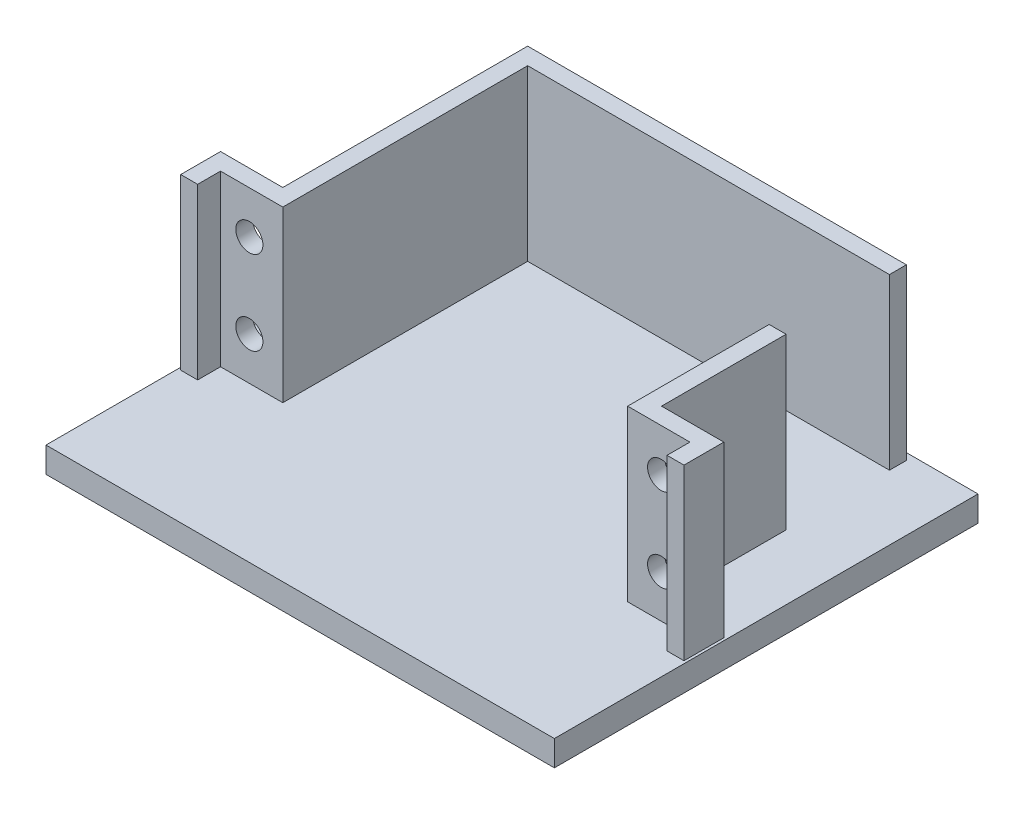
ISO-10303-21;
HEADER;
FILE_DESCRIPTION(('STEP AP214'),'2;1');
FILE_NAME('part.step','',(''),(''),'','','');
FILE_SCHEMA(('AUTOMOTIVE_DESIGN { 1 0 10303 214 1 1 1 1 }'));
ENDSEC;
DATA;
#1=APPLICATION_CONTEXT('core data for automotive mechanical design processes');
#2=APPLICATION_PROTOCOL_DEFINITION('international standard','automotive_design',2000,#1);
#3=PRODUCT_CONTEXT('',#1,'mechanical');
#4=PRODUCT('Part','Part','',(#3));
#5=PRODUCT_RELATED_PRODUCT_CATEGORY('part','',(#4));
#6=PRODUCT_DEFINITION_FORMATION('','',#4);
#7=PRODUCT_DEFINITION_CONTEXT('part definition',#1,'design');
#8=PRODUCT_DEFINITION('design','',#6,#7);
#9=PRODUCT_DEFINITION_SHAPE('','',#8);
#10=(LENGTH_UNIT() NAMED_UNIT(*) SI_UNIT(.MILLI.,.METRE.));
#11=(NAMED_UNIT(*) PLANE_ANGLE_UNIT() SI_UNIT($,.RADIAN.));
#12=(NAMED_UNIT(*) SI_UNIT($,.STERADIAN.) SOLID_ANGLE_UNIT());
#13=UNCERTAINTY_MEASURE_WITH_UNIT(LENGTH_MEASURE(1.E-05),#10,'distance_accuracy_value','');
#14=(GEOMETRIC_REPRESENTATION_CONTEXT(3) GLOBAL_UNCERTAINTY_ASSIGNED_CONTEXT((#13)) GLOBAL_UNIT_ASSIGNED_CONTEXT((#10,
#11,#12)) REPRESENTATION_CONTEXT('',''));
#15=CARTESIAN_POINT('',(0.,0.,0.));
#16=DIRECTION('',(0.,0.,1.));
#17=DIRECTION('',(1.,0.,0.));
#18=AXIS2_PLACEMENT_3D('',#15,#16,#17);
#19=CARTESIAN_POINT('',(0.,0.,0.));
#20=DIRECTION('',(0.,1.,0.));
#21=DIRECTION('',(0.,0.,1.));
#22=AXIS2_PLACEMENT_3D('',#19,#20,#21);
#23=PLANE('',#22);
#24=DIRECTION('',(0.,0.,1.));
#25=VECTOR('',#24,1.);
#26=CARTESIAN_POINT('',(-30.,0.,-25.));
#27=LINE('',#26,#25);
#28=CARTESIAN_POINT('',(-30.,0.,-25.));
#29=VERTEX_POINT('',#28);
#30=CARTESIAN_POINT('',(-30.,0.,25.));
#31=VERTEX_POINT('',#30);
#32=EDGE_CURVE('E271',#29,#31,#27,.T.);
#33=ORIENTED_EDGE('',*,*,#32,.T.);
#34=DIRECTION('',(1.,0.,0.));
#35=VECTOR('',#34,1.);
#36=CARTESIAN_POINT('',(-30.,0.,25.));
#37=LINE('',#36,#35);
#38=CARTESIAN_POINT('',(30.,0.,25.));
#39=VERTEX_POINT('',#38);
#40=EDGE_CURVE('E288',#31,#39,#37,.T.);
#41=ORIENTED_EDGE('',*,*,#40,.T.);
#42=DIRECTION('',(0.,0.,-1.));
#43=VECTOR('',#42,1.);
#44=CARTESIAN_POINT('',(30.,0.,-25.));
#45=LINE('',#44,#43);
#46=CARTESIAN_POINT('',(30.,0.,-25.));
#47=VERTEX_POINT('',#46);
#48=EDGE_CURVE('E291',#39,#47,#45,.T.);
#49=ORIENTED_EDGE('',*,*,#48,.T.);
#50=DIRECTION('',(-1.,0.,0.));
#51=VECTOR('',#50,1.);
#52=CARTESIAN_POINT('',(-30.,0.,-25.));
#53=LINE('',#52,#51);
#54=EDGE_CURVE('E276',#47,#29,#53,.T.);
#55=ORIENTED_EDGE('',*,*,#54,.T.);
#56=EDGE_LOOP('',(#33,#41,#49,#55));
#57=FACE_BOUND('',#56,.T.);
#58=DIRECTION('',(0.,0.,-1.));
#59=VECTOR('',#58,1.);
#60=CARTESIAN_POINT('',(-27.7,0.,6.69999999999999));
#61=LINE('',#60,#59);
#62=CARTESIAN_POINT('',(-27.7,0.,9.39999999999999));
#63=VERTEX_POINT('',#62);
#64=CARTESIAN_POINT('',(-27.7,0.,6.69999999999999));
#65=VERTEX_POINT('',#64);
#66=EDGE_CURVE('E85',#63,#65,#61,.T.);
#67=ORIENTED_EDGE('',*,*,#66,.F.);
#68=DIRECTION('',(1.,0.,0.));
#69=VECTOR('',#68,1.);
#70=CARTESIAN_POINT('',(-29.7,0.,9.39999999999999));
#71=LINE('',#70,#69);
#72=CARTESIAN_POINT('',(-29.7,0.,9.39999999999999));
#73=VERTEX_POINT('',#72);
#74=EDGE_CURVE('E159',#73,#63,#71,.T.);
#75=ORIENTED_EDGE('',*,*,#74,.F.);
#76=DIRECTION('',(0.,0.,1.));
#77=VECTOR('',#76,1.);
#78=CARTESIAN_POINT('',(-29.7,0.,4.69999999999999));
#79=LINE('',#78,#77);
#80=CARTESIAN_POINT('',(-29.7,0.,4.69999999999999));
#81=VERTEX_POINT('',#80);
#82=EDGE_CURVE('E157',#81,#73,#79,.T.);
#83=ORIENTED_EDGE('',*,*,#82,.F.);
#84=DIRECTION('',(-1.,0.,0.));
#85=VECTOR('',#84,1.);
#86=CARTESIAN_POINT('',(-22.35,0.,4.69999999999999));
#87=LINE('',#86,#85);
#88=CARTESIAN_POINT('',(-22.35,0.,4.69999999999999));
#89=VERTEX_POINT('',#88);
#90=EDGE_CURVE('E126',#89,#81,#87,.T.);
#91=ORIENTED_EDGE('',*,*,#90,.F.);
#92=DIRECTION('',(0.,0.,1.));
#93=VECTOR('',#92,1.);
#94=CARTESIAN_POINT('',(-22.35,0.,-24.2000000000001));
#95=LINE('',#94,#93);
#96=CARTESIAN_POINT('',(-22.35,0.,-24.2000000000001));
#97=VERTEX_POINT('',#96);
#98=EDGE_CURVE('E153',#97,#89,#95,.T.);
#99=ORIENTED_EDGE('',*,*,#98,.F.);
#100=DIRECTION('',(-1.,0.,0.));
#101=VECTOR('',#100,1.);
#102=CARTESIAN_POINT('',(-22.35,0.,-24.2000000000001));
#103=LINE('',#102,#101);
#104=CARTESIAN_POINT('',(22.35,0.,-24.2000000000001));
#105=VERTEX_POINT('',#104);
#106=EDGE_CURVE('E150',#105,#97,#103,.T.);
#107=ORIENTED_EDGE('',*,*,#106,.F.);
#108=DIRECTION('',(0.,0.,-1.));
#109=VECTOR('',#108,1.);
#110=CARTESIAN_POINT('',(22.35,0.,-24.2000000000001));
#111=LINE('',#110,#109);
#112=CARTESIAN_POINT('',(22.35,0.,-22.2000000000001));
#113=VERTEX_POINT('',#112);
#114=EDGE_CURVE('E147',#113,#105,#111,.T.);
#115=ORIENTED_EDGE('',*,*,#114,.F.);
#116=DIRECTION('',(1.,0.,0.));
#117=VECTOR('',#116,1.);
#118=CARTESIAN_POINT('',(-20.35,0.,-22.2000000000001));
#119=LINE('',#118,#117);
#120=CARTESIAN_POINT('',(-20.35,0.,-22.2000000000001));
#121=VERTEX_POINT('',#120);
#122=EDGE_CURVE('E144',#121,#113,#119,.T.);
#123=ORIENTED_EDGE('',*,*,#122,.F.);
#124=DIRECTION('',(0.,0.,-1.));
#125=VECTOR('',#124,1.);
#126=CARTESIAN_POINT('',(-20.35,0.,-22.2000000000001));
#127=LINE('',#126,#125);
#128=CARTESIAN_POINT('',(-20.35,0.,6.69999999999999));
#129=VERTEX_POINT('',#128);
#130=EDGE_CURVE('E75',#129,#121,#127,.T.);
#131=ORIENTED_EDGE('',*,*,#130,.F.);
#132=DIRECTION('',(1.,0.,0.));
#133=VECTOR('',#132,1.);
#134=CARTESIAN_POINT('',(-20.35,0.,6.69999999999999));
#135=LINE('',#134,#133);
#136=EDGE_CURVE('E140',#65,#129,#135,.T.);
#137=ORIENTED_EDGE('',*,*,#136,.F.);
#138=EDGE_LOOP('',(#67,#75,#83,#91,#99,#107,#115,#123,#131,#137));
#139=FACE_BOUND('',#138,.T.);
#140=DIRECTION('',(0.,0.,-1.));
#141=VECTOR('',#140,1.);
#142=CARTESIAN_POINT('',(29.7,0.,4.69999999999998));
#143=LINE('',#142,#141);
#144=CARTESIAN_POINT('',(29.7,0.,9.39999999999999));
#145=VERTEX_POINT('',#144);
#146=CARTESIAN_POINT('',(29.7,0.,4.69999999999998));
#147=VERTEX_POINT('',#146);
#148=EDGE_CURVE('E232',#145,#147,#143,.T.);
#149=ORIENTED_EDGE('',*,*,#148,.F.);
#150=DIRECTION('',(1.,0.,0.));
#151=VECTOR('',#150,1.);
#152=CARTESIAN_POINT('',(27.7,0.,9.39999999999999));
#153=LINE('',#152,#151);
#154=CARTESIAN_POINT('',(27.7,0.,9.39999999999999));
#155=VERTEX_POINT('',#154);
#156=EDGE_CURVE('E203',#155,#145,#153,.T.);
#157=ORIENTED_EDGE('',*,*,#156,.F.);
#158=DIRECTION('',(0.,0.,1.));
#159=VECTOR('',#158,1.);
#160=CARTESIAN_POINT('',(27.7,0.,6.69999999999998));
#161=LINE('',#160,#159);
#162=CARTESIAN_POINT('',(27.7,0.,6.69999999999998));
#163=VERTEX_POINT('',#162);
#164=EDGE_CURVE('E208',#163,#155,#161,.T.);
#165=ORIENTED_EDGE('',*,*,#164,.F.);
#166=DIRECTION('',(1.,0.,0.));
#167=VECTOR('',#166,1.);
#168=CARTESIAN_POINT('',(20.35,0.,6.69999999999998));
#169=LINE('',#168,#167);
#170=CARTESIAN_POINT('',(20.35,0.,6.69999999999998));
#171=VERTEX_POINT('',#170);
#172=EDGE_CURVE('E247',#171,#163,#169,.T.);
#173=ORIENTED_EDGE('',*,*,#172,.F.);
#174=DIRECTION('',(0.,0.,1.));
#175=VECTOR('',#174,1.);
#176=CARTESIAN_POINT('',(20.35,0.,6.69999999999998));
#177=LINE('',#176,#175);
#178=CARTESIAN_POINT('',(20.35,0.,-10.));
#179=VERTEX_POINT('',#178);
#180=EDGE_CURVE('E244',#179,#171,#177,.T.);
#181=ORIENTED_EDGE('',*,*,#180,.F.);
#182=DIRECTION('',(-1.,0.,0.));
#183=VECTOR('',#182,1.);
#184=CARTESIAN_POINT('',(20.35,0.,-10.));
#185=LINE('',#184,#183);
#186=CARTESIAN_POINT('',(22.35,0.,-10.));
#187=VERTEX_POINT('',#186);
#188=EDGE_CURVE('E241',#187,#179,#185,.T.);
#189=ORIENTED_EDGE('',*,*,#188,.F.);
#190=DIRECTION('',(0.,0.,-1.));
#191=VECTOR('',#190,1.);
#192=CARTESIAN_POINT('',(22.35,0.,4.69999999999998));
#193=LINE('',#192,#191);
#194=CARTESIAN_POINT('',(22.35,0.,4.69999999999998));
#195=VERTEX_POINT('',#194);
#196=EDGE_CURVE('E238',#195,#187,#193,.T.);
#197=ORIENTED_EDGE('',*,*,#196,.F.);
#198=DIRECTION('',(-1.,0.,0.));
#199=VECTOR('',#198,1.);
#200=CARTESIAN_POINT('',(22.35,0.,4.69999999999998));
#201=LINE('',#200,#199);
#202=EDGE_CURVE('E235',#147,#195,#201,.T.);
#203=ORIENTED_EDGE('',*,*,#202,.F.);
#204=EDGE_LOOP('',(#149,#157,#165,#173,#181,#189,#197,#203));
#205=FACE_BOUND('',#204,.T.);
#206=ADVANCED_FACE('F36',(#57,#139,#205),#23,.T.);
#207=CARTESIAN_POINT('',(-27.7,20.,6.69999999999999));
#208=DIRECTION('',(-1.,0.,0.));
#209=DIRECTION('',(0.,0.,1.));
#210=AXIS2_PLACEMENT_3D('',#207,#208,#209);
#211=PLANE('',#210);
#212=ORIENTED_EDGE('',*,*,#66,.T.);
#213=DIRECTION('',(0.,-1.,0.));
#214=VECTOR('',#213,1.);
#215=CARTESIAN_POINT('',(-27.7,20.,6.69999999999999));
#216=LINE('',#215,#214);
#217=CARTESIAN_POINT('',(-27.7,20.,6.69999999999999));
#218=VERTEX_POINT('',#217);
#219=EDGE_CURVE('E11',#218,#65,#216,.T.);
#220=ORIENTED_EDGE('',*,*,#219,.F.);
#221=DIRECTION('',(0.,0.,-1.));
#222=VECTOR('',#221,1.);
#223=CARTESIAN_POINT('',(-27.7,20.,6.69999999999999));
#224=LINE('',#223,#222);
#225=CARTESIAN_POINT('',(-27.7,20.,9.39999999999999));
#226=VERTEX_POINT('',#225);
#227=EDGE_CURVE('E161',#226,#218,#224,.T.);
#228=ORIENTED_EDGE('',*,*,#227,.F.);
#229=DIRECTION('',(0.,-1.,0.));
#230=VECTOR('',#229,1.);
#231=CARTESIAN_POINT('',(-27.7,20.,9.39999999999999));
#232=LINE('',#231,#230);
#233=EDGE_CURVE('E135',#226,#63,#232,.T.);
#234=ORIENTED_EDGE('',*,*,#233,.T.);
#235=EDGE_LOOP('',(#212,#220,#228,#234));
#236=FACE_BOUND('',#235,.T.);
#237=ADVANCED_FACE('F38',(#236),#211,.F.);
#238=CARTESIAN_POINT('',(-20.35,20.,6.69999999999999));
#239=DIRECTION('',(0.,0.,-1.));
#240=DIRECTION('',(-1.,0.,0.));
#241=AXIS2_PLACEMENT_3D('',#238,#239,#240);
#242=PLANE('',#241);
#243=CARTESIAN_POINT('',(-24.3,5.05,6.69999999999999));
#244=DIRECTION('',(0.,0.,-1.));
#245=DIRECTION('',(-1.,0.,0.));
#246=AXIS2_PLACEMENT_3D('',#243,#244,#245);
#247=CIRCLE('',#246,1.6);
#248=CARTESIAN_POINT('',(-25.9,5.05,6.69999999999999));
#249=VERTEX_POINT('',#248);
#250=EDGE_CURVE('E200',#249,#249,#247,.F.);
#251=ORIENTED_EDGE('',*,*,#250,.F.);
#252=EDGE_LOOP('',(#251));
#253=FACE_BOUND('',#252,.T.);
#254=CARTESIAN_POINT('',(-24.3,14.95,6.69999999999999));
#255=DIRECTION('',(0.,0.,-1.));
#256=DIRECTION('',(-1.,0.,0.));
#257=AXIS2_PLACEMENT_3D('',#254,#255,#256);
#258=CIRCLE('',#257,1.6);
#259=CARTESIAN_POINT('',(-25.9,14.95,6.69999999999999));
#260=VERTEX_POINT('',#259);
#261=EDGE_CURVE('E189',#260,#260,#258,.F.);
#262=ORIENTED_EDGE('',*,*,#261,.F.);
#263=EDGE_LOOP('',(#262));
#264=FACE_BOUND('',#263,.T.);
#265=ORIENTED_EDGE('',*,*,#136,.T.);
#266=DIRECTION('',(0.,-1.,0.));
#267=VECTOR('',#266,1.);
#268=CARTESIAN_POINT('',(-20.35,20.,6.69999999999999));
#269=LINE('',#268,#267);
#270=CARTESIAN_POINT('',(-20.35,20.,6.69999999999999));
#271=VERTEX_POINT('',#270);
#272=EDGE_CURVE('E45',#271,#129,#269,.T.);
#273=ORIENTED_EDGE('',*,*,#272,.F.);
#274=DIRECTION('',(1.,0.,0.));
#275=VECTOR('',#274,1.);
#276=CARTESIAN_POINT('',(-20.35,20.,6.69999999999999));
#277=LINE('',#276,#275);
#278=EDGE_CURVE('E307',#218,#271,#277,.T.);
#279=ORIENTED_EDGE('',*,*,#278,.F.);
#280=ORIENTED_EDGE('',*,*,#219,.T.);
#281=EDGE_LOOP('',(#265,#273,#279,#280));
#282=FACE_BOUND('',#281,.T.);
#283=ADVANCED_FACE('F446',(#253,#264,#282),#242,.F.);
#284=CARTESIAN_POINT('',(-20.35,20.,-22.2000000000001));
#285=DIRECTION('',(-1.,0.,0.));
#286=DIRECTION('',(0.,0.,1.));
#287=AXIS2_PLACEMENT_3D('',#284,#285,#286);
#288=PLANE('',#287);
#289=ORIENTED_EDGE('',*,*,#130,.T.);
#290=DIRECTION('',(0.,-1.,0.));
#291=VECTOR('',#290,1.);
#292=CARTESIAN_POINT('',(-20.35,20.,-22.2000000000001));
#293=LINE('',#292,#291);
#294=CARTESIAN_POINT('',(-20.35,20.,-22.2000000000001));
#295=VERTEX_POINT('',#294);
#296=EDGE_CURVE('E175',#295,#121,#293,.T.);
#297=ORIENTED_EDGE('',*,*,#296,.F.);
#298=DIRECTION('',(0.,0.,-1.));
#299=VECTOR('',#298,1.);
#300=CARTESIAN_POINT('',(-20.35,20.,-22.2000000000001));
#301=LINE('',#300,#299);
#302=EDGE_CURVE('E309',#271,#295,#301,.T.);
#303=ORIENTED_EDGE('',*,*,#302,.F.);
#304=ORIENTED_EDGE('',*,*,#272,.T.);
#305=EDGE_LOOP('',(#289,#297,#303,#304));
#306=FACE_BOUND('',#305,.T.);
#307=ADVANCED_FACE('F490',(#306),#288,.F.);
#308=CARTESIAN_POINT('',(-20.35,20.,-22.2000000000001));
#309=DIRECTION('',(0.,0.,-1.));
#310=DIRECTION('',(-1.,0.,0.));
#311=AXIS2_PLACEMENT_3D('',#308,#309,#310);
#312=PLANE('',#311);
#313=ORIENTED_EDGE('',*,*,#122,.T.);
#314=DIRECTION('',(0.,-1.,0.));
#315=VECTOR('',#314,1.);
#316=CARTESIAN_POINT('',(22.35,20.,-22.2000000000001));
#317=LINE('',#316,#315);
#318=CARTESIAN_POINT('',(22.35,20.,-22.2000000000001));
#319=VERTEX_POINT('',#318);
#320=EDGE_CURVE('E172',#319,#113,#317,.T.);
#321=ORIENTED_EDGE('',*,*,#320,.F.);
#322=DIRECTION('',(1.,0.,0.));
#323=VECTOR('',#322,1.);
#324=CARTESIAN_POINT('',(-20.35,20.,-22.2000000000001));
#325=LINE('',#324,#323);
#326=EDGE_CURVE('E311',#295,#319,#325,.T.);
#327=ORIENTED_EDGE('',*,*,#326,.F.);
#328=ORIENTED_EDGE('',*,*,#296,.T.);
#329=EDGE_LOOP('',(#313,#321,#327,#328));
#330=FACE_BOUND('',#329,.T.);
#331=ADVANCED_FACE('F486',(#330),#312,.F.);
#332=CARTESIAN_POINT('',(22.35,20.,-24.2000000000001));
#333=DIRECTION('',(-1.,0.,0.));
#334=DIRECTION('',(0.,0.,1.));
#335=AXIS2_PLACEMENT_3D('',#332,#333,#334);
#336=PLANE('',#335);
#337=ORIENTED_EDGE('',*,*,#114,.T.);
#338=DIRECTION('',(0.,-1.,0.));
#339=VECTOR('',#338,1.);
#340=CARTESIAN_POINT('',(22.35,20.,-24.2000000000001));
#341=LINE('',#340,#339);
#342=CARTESIAN_POINT('',(22.35,20.,-24.2000000000001));
#343=VERTEX_POINT('',#342);
#344=EDGE_CURVE('E169',#343,#105,#341,.T.);
#345=ORIENTED_EDGE('',*,*,#344,.F.);
#346=DIRECTION('',(0.,0.,-1.));
#347=VECTOR('',#346,1.);
#348=CARTESIAN_POINT('',(22.35,20.,-24.2000000000001));
#349=LINE('',#348,#347);
#350=EDGE_CURVE('E313',#319,#343,#349,.T.);
#351=ORIENTED_EDGE('',*,*,#350,.F.);
#352=ORIENTED_EDGE('',*,*,#320,.T.);
#353=EDGE_LOOP('',(#337,#345,#351,#352));
#354=FACE_BOUND('',#353,.T.);
#355=ADVANCED_FACE('F483',(#354),#336,.F.);
#356=CARTESIAN_POINT('',(-22.35,20.,-24.2000000000001));
#357=DIRECTION('',(0.,0.,1.));
#358=DIRECTION('',(1.,0.,0.));
#359=AXIS2_PLACEMENT_3D('',#356,#357,#358);
#360=PLANE('',#359);
#361=ORIENTED_EDGE('',*,*,#106,.T.);
#362=DIRECTION('',(0.,-1.,0.));
#363=VECTOR('',#362,1.);
#364=CARTESIAN_POINT('',(-22.35,20.,-24.2000000000001));
#365=LINE('',#364,#363);
#366=CARTESIAN_POINT('',(-22.35,20.,-24.2000000000001));
#367=VERTEX_POINT('',#366);
#368=EDGE_CURVE('E166',#367,#97,#365,.T.);
#369=ORIENTED_EDGE('',*,*,#368,.F.);
#370=DIRECTION('',(-1.,0.,0.));
#371=VECTOR('',#370,1.);
#372=CARTESIAN_POINT('',(-22.35,20.,-24.2000000000001));
#373=LINE('',#372,#371);
#374=EDGE_CURVE('E315',#343,#367,#373,.T.);
#375=ORIENTED_EDGE('',*,*,#374,.F.);
#376=ORIENTED_EDGE('',*,*,#344,.T.);
#377=EDGE_LOOP('',(#361,#369,#375,#376));
#378=FACE_BOUND('',#377,.T.);
#379=ADVANCED_FACE('F321',(#378),#360,.F.);
#380=CARTESIAN_POINT('',(-22.35,20.,-24.2000000000001));
#381=DIRECTION('',(1.,0.,0.));
#382=DIRECTION('',(0.,0.,-1.));
#383=AXIS2_PLACEMENT_3D('',#380,#381,#382);
#384=PLANE('',#383);
#385=ORIENTED_EDGE('',*,*,#98,.T.);
#386=DIRECTION('',(0.,-1.,0.));
#387=VECTOR('',#386,1.);
#388=CARTESIAN_POINT('',(-22.35,20.,4.69999999999999));
#389=LINE('',#388,#387);
#390=CARTESIAN_POINT('',(-22.35,20.,4.69999999999999));
#391=VERTEX_POINT('',#390);
#392=EDGE_CURVE('E129',#391,#89,#389,.T.);
#393=ORIENTED_EDGE('',*,*,#392,.F.);
#394=DIRECTION('',(0.,0.,1.));
#395=VECTOR('',#394,1.);
#396=CARTESIAN_POINT('',(-22.35,20.,-24.2000000000001));
#397=LINE('',#396,#395);
#398=EDGE_CURVE('E116',#367,#391,#397,.T.);
#399=ORIENTED_EDGE('',*,*,#398,.F.);
#400=ORIENTED_EDGE('',*,*,#368,.T.);
#401=EDGE_LOOP('',(#385,#393,#399,#400));
#402=FACE_BOUND('',#401,.T.);
#403=ADVANCED_FACE('F325',(#402),#384,.F.);
#404=CARTESIAN_POINT('',(-22.35,20.,4.69999999999999));
#405=DIRECTION('',(0.,0.,1.));
#406=DIRECTION('',(1.,0.,0.));
#407=AXIS2_PLACEMENT_3D('',#404,#405,#406);
#408=PLANE('',#407);
#409=CARTESIAN_POINT('',(-24.3,5.05,4.69999999999999));
#410=DIRECTION('',(0.,0.,1.));
#411=DIRECTION('',(1.,0.,0.));
#412=AXIS2_PLACEMENT_3D('',#409,#410,#411);
#413=CIRCLE('',#412,1.6);
#414=CARTESIAN_POINT('',(-22.7,5.05,4.69999999999999));
#415=VERTEX_POINT('',#414);
#416=EDGE_CURVE('E40',#415,#415,#413,.F.);
#417=ORIENTED_EDGE('',*,*,#416,.F.);
#418=EDGE_LOOP('',(#417));
#419=FACE_BOUND('',#418,.T.);
#420=CARTESIAN_POINT('',(-24.3,14.95,4.69999999999999));
#421=DIRECTION('',(0.,0.,1.));
#422=DIRECTION('',(1.,0.,0.));
#423=AXIS2_PLACEMENT_3D('',#420,#421,#422);
#424=CIRCLE('',#423,1.6);
#425=CARTESIAN_POINT('',(-22.7,14.95,4.69999999999999));
#426=VERTEX_POINT('',#425);
#427=EDGE_CURVE('E187',#426,#426,#424,.F.);
#428=ORIENTED_EDGE('',*,*,#427,.F.);
#429=EDGE_LOOP('',(#428));
#430=FACE_BOUND('',#429,.T.);
#431=ORIENTED_EDGE('',*,*,#90,.T.);
#432=DIRECTION('',(0.,-1.,0.));
#433=VECTOR('',#432,1.);
#434=CARTESIAN_POINT('',(-29.7,20.,4.69999999999999));
#435=LINE('',#434,#433);
#436=CARTESIAN_POINT('',(-29.7,20.,4.69999999999999));
#437=VERTEX_POINT('',#436);
#438=EDGE_CURVE('E123',#437,#81,#435,.T.);
#439=ORIENTED_EDGE('',*,*,#438,.F.);
#440=DIRECTION('',(-1.,0.,0.));
#441=VECTOR('',#440,1.);
#442=CARTESIAN_POINT('',(-22.35,20.,4.69999999999999));
#443=LINE('',#442,#441);
#444=EDGE_CURVE('E109',#391,#437,#443,.T.);
#445=ORIENTED_EDGE('',*,*,#444,.F.);
#446=ORIENTED_EDGE('',*,*,#392,.T.);
#447=EDGE_LOOP('',(#431,#439,#445,#446));
#448=FACE_BOUND('',#447,.T.);
#449=ADVANCED_FACE('F124',(#419,#430,#448),#408,.F.);
#450=CARTESIAN_POINT('',(-29.7,20.,4.69999999999999));
#451=DIRECTION('',(1.,0.,0.));
#452=DIRECTION('',(0.,0.,-1.));
#453=AXIS2_PLACEMENT_3D('',#450,#451,#452);
#454=PLANE('',#453);
#455=ORIENTED_EDGE('',*,*,#82,.T.);
#456=DIRECTION('',(0.,-1.,0.));
#457=VECTOR('',#456,1.);
#458=CARTESIAN_POINT('',(-29.7,20.,9.39999999999999));
#459=LINE('',#458,#457);
#460=CARTESIAN_POINT('',(-29.7,20.,9.39999999999999));
#461=VERTEX_POINT('',#460);
#462=EDGE_CURVE('E130',#461,#73,#459,.T.);
#463=ORIENTED_EDGE('',*,*,#462,.F.);
#464=DIRECTION('',(0.,0.,1.));
#465=VECTOR('',#464,1.);
#466=CARTESIAN_POINT('',(-29.7,20.,4.69999999999999));
#467=LINE('',#466,#465);
#468=EDGE_CURVE('E113',#437,#461,#467,.T.);
#469=ORIENTED_EDGE('',*,*,#468,.F.);
#470=ORIENTED_EDGE('',*,*,#438,.T.);
#471=EDGE_LOOP('',(#455,#463,#469,#470));
#472=FACE_BOUND('',#471,.T.);
#473=ADVANCED_FACE('F132',(#472),#454,.F.);
#474=CARTESIAN_POINT('',(-29.7,20.,9.39999999999999));
#475=DIRECTION('',(0.,0.,-1.));
#476=DIRECTION('',(-1.,0.,0.));
#477=AXIS2_PLACEMENT_3D('',#474,#475,#476);
#478=PLANE('',#477);
#479=ORIENTED_EDGE('',*,*,#74,.T.);
#480=ORIENTED_EDGE('',*,*,#233,.F.);
#481=DIRECTION('',(1.,0.,0.));
#482=VECTOR('',#481,1.);
#483=CARTESIAN_POINT('',(-29.7,20.,9.39999999999999));
#484=LINE('',#483,#482);
#485=EDGE_CURVE('E62',#461,#226,#484,.T.);
#486=ORIENTED_EDGE('',*,*,#485,.F.);
#487=ORIENTED_EDGE('',*,*,#462,.T.);
#488=EDGE_LOOP('',(#479,#480,#486,#487));
#489=FACE_BOUND('',#488,.T.);
#490=ADVANCED_FACE('F470',(#489),#478,.F.);
#491=CARTESIAN_POINT('',(0.,20.,0.));
#492=DIRECTION('',(0.,1.,0.));
#493=DIRECTION('',(0.,0.,1.));
#494=AXIS2_PLACEMENT_3D('',#491,#492,#493);
#495=PLANE('',#494);
#496=ORIENTED_EDGE('',*,*,#227,.T.);
#497=ORIENTED_EDGE('',*,*,#278,.T.);
#498=ORIENTED_EDGE('',*,*,#302,.T.);
#499=ORIENTED_EDGE('',*,*,#326,.T.);
#500=ORIENTED_EDGE('',*,*,#350,.T.);
#501=ORIENTED_EDGE('',*,*,#374,.T.);
#502=ORIENTED_EDGE('',*,*,#398,.T.);
#503=ORIENTED_EDGE('',*,*,#444,.T.);
#504=ORIENTED_EDGE('',*,*,#468,.T.);
#505=ORIENTED_EDGE('',*,*,#485,.T.);
#506=EDGE_LOOP('',(#496,#497,#498,#499,#500,#501,#502,#503,#504,#505));
#507=FACE_BOUND('',#506,.T.);
#508=ADVANCED_FACE('F111',(#507),#495,.T.);
#509=CARTESIAN_POINT('',(-30.,-3.,-25.));
#510=DIRECTION('',(-1.,0.,0.));
#511=DIRECTION('',(0.,0.,1.));
#512=AXIS2_PLACEMENT_3D('',#509,#510,#511);
#513=PLANE('',#512);
#514=ORIENTED_EDGE('',*,*,#32,.F.);
#515=DIRECTION('',(0.,1.,0.));
#516=VECTOR('',#515,1.);
#517=CARTESIAN_POINT('',(-30.,-3.,-25.));
#518=LINE('',#517,#516);
#519=CARTESIAN_POINT('',(-30.,-3.,-25.));
#520=VERTEX_POINT('',#519);
#521=EDGE_CURVE('E141',#520,#29,#518,.T.);
#522=ORIENTED_EDGE('',*,*,#521,.F.);
#523=DIRECTION('',(0.,0.,1.));
#524=VECTOR('',#523,1.);
#525=CARTESIAN_POINT('',(-30.,-3.,-25.));
#526=LINE('',#525,#524);
#527=CARTESIAN_POINT('',(-30.,-3.,25.));
#528=VERTEX_POINT('',#527);
#529=EDGE_CURVE('E272',#520,#528,#526,.T.);
#530=ORIENTED_EDGE('',*,*,#529,.T.);
#531=DIRECTION('',(0.,1.,0.));
#532=VECTOR('',#531,1.);
#533=CARTESIAN_POINT('',(-30.,-3.,25.));
#534=LINE('',#533,#532);
#535=EDGE_CURVE('E285',#528,#31,#534,.T.);
#536=ORIENTED_EDGE('',*,*,#535,.T.);
#537=EDGE_LOOP('',(#514,#522,#530,#536));
#538=FACE_BOUND('',#537,.T.);
#539=ADVANCED_FACE('F456',(#538),#513,.T.);
#540=CARTESIAN_POINT('',(-30.,-3.,-25.));
#541=DIRECTION('',(0.,0.,-1.));
#542=DIRECTION('',(-1.,0.,0.));
#543=AXIS2_PLACEMENT_3D('',#540,#541,#542);
#544=PLANE('',#543);
#545=ORIENTED_EDGE('',*,*,#54,.F.);
#546=DIRECTION('',(0.,1.,0.));
#547=VECTOR('',#546,1.);
#548=CARTESIAN_POINT('',(30.,-3.,-25.));
#549=LINE('',#548,#547);
#550=CARTESIAN_POINT('',(30.,-3.,-25.));
#551=VERTEX_POINT('',#550);
#552=EDGE_CURVE('E298',#551,#47,#549,.T.);
#553=ORIENTED_EDGE('',*,*,#552,.F.);
#554=DIRECTION('',(-1.,0.,0.));
#555=VECTOR('',#554,1.);
#556=CARTESIAN_POINT('',(-30.,-3.,-25.));
#557=LINE('',#556,#555);
#558=EDGE_CURVE('E282',#551,#520,#557,.T.);
#559=ORIENTED_EDGE('',*,*,#558,.T.);
#560=ORIENTED_EDGE('',*,*,#521,.T.);
#561=EDGE_LOOP('',(#545,#553,#559,#560));
#562=FACE_BOUND('',#561,.T.);
#563=ADVANCED_FACE('F452',(#562),#544,.T.);
#564=CARTESIAN_POINT('',(30.,-3.,-25.));
#565=DIRECTION('',(1.,0.,0.));
#566=DIRECTION('',(0.,0.,-1.));
#567=AXIS2_PLACEMENT_3D('',#564,#565,#566);
#568=PLANE('',#567);
#569=ORIENTED_EDGE('',*,*,#48,.F.);
#570=DIRECTION('',(0.,1.,0.));
#571=VECTOR('',#570,1.);
#572=CARTESIAN_POINT('',(30.,-3.,25.));
#573=LINE('',#572,#571);
#574=CARTESIAN_POINT('',(30.,-3.,25.));
#575=VERTEX_POINT('',#574);
#576=EDGE_CURVE('E301',#575,#39,#573,.T.);
#577=ORIENTED_EDGE('',*,*,#576,.F.);
#578=DIRECTION('',(0.,0.,-1.));
#579=VECTOR('',#578,1.);
#580=CARTESIAN_POINT('',(30.,-3.,-25.));
#581=LINE('',#580,#579);
#582=EDGE_CURVE('E279',#575,#551,#581,.T.);
#583=ORIENTED_EDGE('',*,*,#582,.T.);
#584=ORIENTED_EDGE('',*,*,#552,.T.);
#585=EDGE_LOOP('',(#569,#577,#583,#584));
#586=FACE_BOUND('',#585,.T.);
#587=ADVANCED_FACE('F455',(#586),#568,.T.);
#588=CARTESIAN_POINT('',(-30.,-3.,25.));
#589=DIRECTION('',(0.,0.,1.));
#590=DIRECTION('',(1.,0.,0.));
#591=AXIS2_PLACEMENT_3D('',#588,#589,#590);
#592=PLANE('',#591);
#593=ORIENTED_EDGE('',*,*,#40,.F.);
#594=ORIENTED_EDGE('',*,*,#535,.F.);
#595=DIRECTION('',(1.,0.,0.));
#596=VECTOR('',#595,1.);
#597=CARTESIAN_POINT('',(-30.,-3.,25.));
#598=LINE('',#597,#596);
#599=EDGE_CURVE('E275',#528,#575,#598,.T.);
#600=ORIENTED_EDGE('',*,*,#599,.T.);
#601=ORIENTED_EDGE('',*,*,#576,.T.);
#602=EDGE_LOOP('',(#593,#594,#600,#601));
#603=FACE_BOUND('',#602,.T.);
#604=ADVANCED_FACE('F460',(#603),#592,.T.);
#605=CARTESIAN_POINT('',(0.,-3.,0.));
#606=DIRECTION('',(0.,1.,0.));
#607=DIRECTION('',(0.,0.,1.));
#608=AXIS2_PLACEMENT_3D('',#605,#606,#607);
#609=PLANE('',#608);
#610=ORIENTED_EDGE('',*,*,#529,.F.);
#611=ORIENTED_EDGE('',*,*,#558,.F.);
#612=ORIENTED_EDGE('',*,*,#582,.F.);
#613=ORIENTED_EDGE('',*,*,#599,.F.);
#614=EDGE_LOOP('',(#610,#611,#612,#613));
#615=FACE_BOUND('',#614,.T.);
#616=ADVANCED_FACE('F450',(#615),#609,.F.);
#617=CARTESIAN_POINT('',(27.7,20.,9.39999999999999));
#618=DIRECTION('',(0.,0.,-1.));
#619=DIRECTION('',(-1.,0.,0.));
#620=AXIS2_PLACEMENT_3D('',#617,#618,#619);
#621=PLANE('',#620);
#622=ORIENTED_EDGE('',*,*,#156,.T.);
#623=DIRECTION('',(0.,-1.,0.));
#624=VECTOR('',#623,1.);
#625=CARTESIAN_POINT('',(29.7,20.,9.39999999999999));
#626=LINE('',#625,#624);
#627=CARTESIAN_POINT('',(29.7,20.,9.39999999999999));
#628=VERTEX_POINT('',#627);
#629=EDGE_CURVE('E268',#628,#145,#626,.T.);
#630=ORIENTED_EDGE('',*,*,#629,.F.);
#631=DIRECTION('',(1.,0.,0.));
#632=VECTOR('',#631,1.);
#633=CARTESIAN_POINT('',(27.7,20.,9.39999999999999));
#634=LINE('',#633,#632);
#635=CARTESIAN_POINT('',(27.7,20.,9.39999999999999));
#636=VERTEX_POINT('',#635);
#637=EDGE_CURVE('E204',#636,#628,#634,.T.);
#638=ORIENTED_EDGE('',*,*,#637,.F.);
#639=DIRECTION('',(0.,-1.,0.));
#640=VECTOR('',#639,1.);
#641=CARTESIAN_POINT('',(27.7,20.,9.39999999999999));
#642=LINE('',#641,#640);
#643=EDGE_CURVE('E229',#636,#155,#642,.T.);
#644=ORIENTED_EDGE('',*,*,#643,.T.);
#645=EDGE_LOOP('',(#622,#630,#638,#644));
#646=FACE_BOUND('',#645,.T.);
#647=ADVANCED_FACE('F401',(#646),#621,.F.);
#648=CARTESIAN_POINT('',(29.7,20.,4.69999999999998));
#649=DIRECTION('',(-1.,0.,0.));
#650=DIRECTION('',(0.,0.,1.));
#651=AXIS2_PLACEMENT_3D('',#648,#649,#650);
#652=PLANE('',#651);
#653=ORIENTED_EDGE('',*,*,#148,.T.);
#654=DIRECTION('',(0.,-1.,0.));
#655=VECTOR('',#654,1.);
#656=CARTESIAN_POINT('',(29.7,20.,4.69999999999998));
#657=LINE('',#656,#655);
#658=CARTESIAN_POINT('',(29.7,20.,4.69999999999998));
#659=VERTEX_POINT('',#658);
#660=EDGE_CURVE('E265',#659,#147,#657,.T.);
#661=ORIENTED_EDGE('',*,*,#660,.F.);
#662=DIRECTION('',(0.,0.,-1.));
#663=VECTOR('',#662,1.);
#664=CARTESIAN_POINT('',(29.7,20.,4.69999999999998));
#665=LINE('',#664,#663);
#666=EDGE_CURVE('E207',#628,#659,#665,.T.);
#667=ORIENTED_EDGE('',*,*,#666,.F.);
#668=ORIENTED_EDGE('',*,*,#629,.T.);
#669=EDGE_LOOP('',(#653,#661,#667,#668));
#670=FACE_BOUND('',#669,.T.);
#671=ADVANCED_FACE('F393',(#670),#652,.F.);
#672=CARTESIAN_POINT('',(22.35,20.,4.69999999999998));
#673=DIRECTION('',(0.,0.,1.));
#674=DIRECTION('',(1.,0.,0.));
#675=AXIS2_PLACEMENT_3D('',#672,#673,#674);
#676=PLANE('',#675);
#677=CARTESIAN_POINT('',(24.3,5.05,4.69999999999998));
#678=DIRECTION('',(0.,0.,1.));
#679=DIRECTION('',(1.,0.,0.));
#680=AXIS2_PLACEMENT_3D('',#677,#678,#679);
#681=CIRCLE('',#680,1.6);
#682=CARTESIAN_POINT('',(25.9,5.05,4.69999999999998));
#683=VERTEX_POINT('',#682);
#684=EDGE_CURVE('E186',#683,#683,#681,.F.);
#685=ORIENTED_EDGE('',*,*,#684,.F.);
#686=EDGE_LOOP('',(#685));
#687=FACE_BOUND('',#686,.T.);
#688=CARTESIAN_POINT('',(24.3,14.95,4.69999999999998));
#689=DIRECTION('',(0.,0.,1.));
#690=DIRECTION('',(1.,0.,0.));
#691=AXIS2_PLACEMENT_3D('',#688,#689,#690);
#692=CIRCLE('',#691,1.6);
#693=CARTESIAN_POINT('',(25.9,14.95,4.69999999999998));
#694=VERTEX_POINT('',#693);
#695=EDGE_CURVE('E183',#694,#694,#692,.F.);
#696=ORIENTED_EDGE('',*,*,#695,.F.);
#697=EDGE_LOOP('',(#696));
#698=FACE_BOUND('',#697,.T.);
#699=ORIENTED_EDGE('',*,*,#202,.T.);
#700=DIRECTION('',(0.,-1.,0.));
#701=VECTOR('',#700,1.);
#702=CARTESIAN_POINT('',(22.35,20.,4.69999999999998));
#703=LINE('',#702,#701);
#704=CARTESIAN_POINT('',(22.35,20.,4.69999999999998));
#705=VERTEX_POINT('',#704);
#706=EDGE_CURVE('E262',#705,#195,#703,.T.);
#707=ORIENTED_EDGE('',*,*,#706,.F.);
#708=DIRECTION('',(-1.,0.,0.));
#709=VECTOR('',#708,1.);
#710=CARTESIAN_POINT('',(22.35,20.,4.69999999999998));
#711=LINE('',#710,#709);
#712=EDGE_CURVE('E211',#659,#705,#711,.T.);
#713=ORIENTED_EDGE('',*,*,#712,.F.);
#714=ORIENTED_EDGE('',*,*,#660,.T.);
#715=EDGE_LOOP('',(#699,#707,#713,#714));
#716=FACE_BOUND('',#715,.T.);
#717=ADVANCED_FACE('F409',(#687,#698,#716),#676,.F.);
#718=CARTESIAN_POINT('',(22.35,20.,4.69999999999998));
#719=DIRECTION('',(-1.,0.,0.));
#720=DIRECTION('',(0.,0.,1.));
#721=AXIS2_PLACEMENT_3D('',#718,#719,#720);
#722=PLANE('',#721);
#723=ORIENTED_EDGE('',*,*,#196,.T.);
#724=DIRECTION('',(0.,-1.,0.));
#725=VECTOR('',#724,1.);
#726=CARTESIAN_POINT('',(22.35,20.,-10.));
#727=LINE('',#726,#725);
#728=CARTESIAN_POINT('',(22.35,20.,-10.));
#729=VERTEX_POINT('',#728);
#730=EDGE_CURVE('E259',#729,#187,#727,.T.);
#731=ORIENTED_EDGE('',*,*,#730,.F.);
#732=DIRECTION('',(0.,0.,-1.));
#733=VECTOR('',#732,1.);
#734=CARTESIAN_POINT('',(22.35,20.,4.69999999999998));
#735=LINE('',#734,#733);
#736=EDGE_CURVE('E214',#705,#729,#735,.T.);
#737=ORIENTED_EDGE('',*,*,#736,.F.);
#738=ORIENTED_EDGE('',*,*,#706,.T.);
#739=EDGE_LOOP('',(#723,#731,#737,#738));
#740=FACE_BOUND('',#739,.T.);
#741=ADVANCED_FACE('F416',(#740),#722,.F.);
#742=CARTESIAN_POINT('',(20.35,20.,-10.));
#743=DIRECTION('',(0.,0.,1.));
#744=DIRECTION('',(1.,0.,0.));
#745=AXIS2_PLACEMENT_3D('',#742,#743,#744);
#746=PLANE('',#745);
#747=ORIENTED_EDGE('',*,*,#188,.T.);
#748=DIRECTION('',(0.,-1.,0.));
#749=VECTOR('',#748,1.);
#750=CARTESIAN_POINT('',(20.35,20.,-10.));
#751=LINE('',#750,#749);
#752=CARTESIAN_POINT('',(20.35,20.,-10.));
#753=VERTEX_POINT('',#752);
#754=EDGE_CURVE('E256',#753,#179,#751,.T.);
#755=ORIENTED_EDGE('',*,*,#754,.F.);
#756=DIRECTION('',(-1.,0.,0.));
#757=VECTOR('',#756,1.);
#758=CARTESIAN_POINT('',(20.35,20.,-10.));
#759=LINE('',#758,#757);
#760=EDGE_CURVE('E217',#729,#753,#759,.T.);
#761=ORIENTED_EDGE('',*,*,#760,.F.);
#762=ORIENTED_EDGE('',*,*,#730,.T.);
#763=EDGE_LOOP('',(#747,#755,#761,#762));
#764=FACE_BOUND('',#763,.T.);
#765=ADVANCED_FACE('F419',(#764),#746,.F.);
#766=CARTESIAN_POINT('',(20.35,20.,6.69999999999998));
#767=DIRECTION('',(1.,0.,0.));
#768=DIRECTION('',(0.,0.,-1.));
#769=AXIS2_PLACEMENT_3D('',#766,#767,#768);
#770=PLANE('',#769);
#771=ORIENTED_EDGE('',*,*,#180,.T.);
#772=DIRECTION('',(0.,-1.,0.));
#773=VECTOR('',#772,1.);
#774=CARTESIAN_POINT('',(20.35,20.,6.69999999999998));
#775=LINE('',#774,#773);
#776=CARTESIAN_POINT('',(20.35,20.,6.69999999999998));
#777=VERTEX_POINT('',#776);
#778=EDGE_CURVE('E253',#777,#171,#775,.T.);
#779=ORIENTED_EDGE('',*,*,#778,.F.);
#780=DIRECTION('',(0.,0.,1.));
#781=VECTOR('',#780,1.);
#782=CARTESIAN_POINT('',(20.35,20.,6.69999999999998));
#783=LINE('',#782,#781);
#784=EDGE_CURVE('E220',#753,#777,#783,.T.);
#785=ORIENTED_EDGE('',*,*,#784,.F.);
#786=ORIENTED_EDGE('',*,*,#754,.T.);
#787=EDGE_LOOP('',(#771,#779,#785,#786));
#788=FACE_BOUND('',#787,.T.);
#789=ADVANCED_FACE('F424',(#788),#770,.F.);
#790=CARTESIAN_POINT('',(20.35,20.,6.69999999999998));
#791=DIRECTION('',(0.,0.,-1.));
#792=DIRECTION('',(-1.,0.,0.));
#793=AXIS2_PLACEMENT_3D('',#790,#791,#792);
#794=PLANE('',#793);
#795=CARTESIAN_POINT('',(24.3,5.05,6.69999999999998));
#796=DIRECTION('',(0.,0.,-1.));
#797=DIRECTION('',(-1.,0.,0.));
#798=AXIS2_PLACEMENT_3D('',#795,#796,#797);
#799=CIRCLE('',#798,1.6);
#800=CARTESIAN_POINT('',(22.7,5.05,6.69999999999998));
#801=VERTEX_POINT('',#800);
#802=EDGE_CURVE('E184',#801,#801,#799,.F.);
#803=ORIENTED_EDGE('',*,*,#802,.F.);
#804=EDGE_LOOP('',(#803));
#805=FACE_BOUND('',#804,.T.);
#806=CARTESIAN_POINT('',(24.3,14.95,6.69999999999998));
#807=DIRECTION('',(0.,0.,-1.));
#808=DIRECTION('',(-1.,0.,0.));
#809=AXIS2_PLACEMENT_3D('',#806,#807,#808);
#810=CIRCLE('',#809,1.6);
#811=CARTESIAN_POINT('',(22.7,14.95,6.69999999999998));
#812=VERTEX_POINT('',#811);
#813=EDGE_CURVE('E180',#812,#812,#810,.F.);
#814=ORIENTED_EDGE('',*,*,#813,.F.);
#815=EDGE_LOOP('',(#814));
#816=FACE_BOUND('',#815,.T.);
#817=ORIENTED_EDGE('',*,*,#172,.T.);
#818=DIRECTION('',(0.,-1.,0.));
#819=VECTOR('',#818,1.);
#820=CARTESIAN_POINT('',(27.7,20.,6.69999999999998));
#821=LINE('',#820,#819);
#822=CARTESIAN_POINT('',(27.7,20.,6.69999999999998));
#823=VERTEX_POINT('',#822);
#824=EDGE_CURVE('E53',#823,#163,#821,.T.);
#825=ORIENTED_EDGE('',*,*,#824,.F.);
#826=DIRECTION('',(1.,0.,0.));
#827=VECTOR('',#826,1.);
#828=CARTESIAN_POINT('',(20.35,20.,6.69999999999998));
#829=LINE('',#828,#827);
#830=EDGE_CURVE('E223',#777,#823,#829,.T.);
#831=ORIENTED_EDGE('',*,*,#830,.F.);
#832=ORIENTED_EDGE('',*,*,#778,.T.);
#833=EDGE_LOOP('',(#817,#825,#831,#832));
#834=FACE_BOUND('',#833,.T.);
#835=ADVANCED_FACE('F427',(#805,#816,#834),#794,.F.);
#836=CARTESIAN_POINT('',(27.7,20.,6.69999999999998));
#837=DIRECTION('',(1.,0.,0.));
#838=DIRECTION('',(0.,0.,-1.));
#839=AXIS2_PLACEMENT_3D('',#836,#837,#838);
#840=PLANE('',#839);
#841=ORIENTED_EDGE('',*,*,#164,.T.);
#842=ORIENTED_EDGE('',*,*,#643,.F.);
#843=DIRECTION('',(0.,0.,1.));
#844=VECTOR('',#843,1.);
#845=CARTESIAN_POINT('',(27.7,20.,6.69999999999998));
#846=LINE('',#845,#844);
#847=EDGE_CURVE('E226',#823,#636,#846,.T.);
#848=ORIENTED_EDGE('',*,*,#847,.F.);
#849=ORIENTED_EDGE('',*,*,#824,.T.);
#850=EDGE_LOOP('',(#841,#842,#848,#849));
#851=FACE_BOUND('',#850,.T.);
#852=ADVANCED_FACE('F429',(#851),#840,.F.);
#853=CARTESIAN_POINT('',(0.,20.,0.));
#854=DIRECTION('',(0.,-1.,0.));
#855=DIRECTION('',(0.,0.,-1.));
#856=AXIS2_PLACEMENT_3D('',#853,#854,#855);
#857=PLANE('',#856);
#858=ORIENTED_EDGE('',*,*,#637,.T.);
#859=ORIENTED_EDGE('',*,*,#666,.T.);
#860=ORIENTED_EDGE('',*,*,#712,.T.);
#861=ORIENTED_EDGE('',*,*,#736,.T.);
#862=ORIENTED_EDGE('',*,*,#760,.T.);
#863=ORIENTED_EDGE('',*,*,#784,.T.);
#864=ORIENTED_EDGE('',*,*,#830,.T.);
#865=ORIENTED_EDGE('',*,*,#847,.T.);
#866=EDGE_LOOP('',(#858,#859,#860,#861,#862,#863,#864,#865));
#867=FACE_BOUND('',#866,.T.);
#868=ADVANCED_FACE('F398',(#867),#857,.F.);
#869=CARTESIAN_POINT('',(24.3,14.95,10.));
#870=DIRECTION('',(0.,0.,-1.));
#871=DIRECTION('',(-1.,0.,0.));
#872=AXIS2_PLACEMENT_3D('',#869,#870,#871);
#873=CYLINDRICAL_SURFACE('',#872,1.6);
#874=ORIENTED_EDGE('',*,*,#813,.T.);
#875=EDGE_LOOP('',(#874));
#876=FACE_BOUND('',#875,.T.);
#877=ORIENTED_EDGE('',*,*,#695,.T.);
#878=EDGE_LOOP('',(#877));
#879=FACE_BOUND('',#878,.T.);
#880=ADVANCED_FACE('F436',(#876,#879),#873,.F.);
#881=CARTESIAN_POINT('',(24.3,5.05,10.));
#882=DIRECTION('',(0.,0.,-1.));
#883=DIRECTION('',(-1.,0.,0.));
#884=AXIS2_PLACEMENT_3D('',#881,#882,#883);
#885=CYLINDRICAL_SURFACE('',#884,1.6);
#886=ORIENTED_EDGE('',*,*,#802,.T.);
#887=EDGE_LOOP('',(#886));
#888=FACE_BOUND('',#887,.T.);
#889=ORIENTED_EDGE('',*,*,#684,.T.);
#890=EDGE_LOOP('',(#889));
#891=FACE_BOUND('',#890,.T.);
#892=ADVANCED_FACE('F513',(#888,#891),#885,.F.);
#893=CARTESIAN_POINT('',(-24.3,14.95,10.));
#894=DIRECTION('',(0.,0.,-1.));
#895=DIRECTION('',(-1.,0.,0.));
#896=AXIS2_PLACEMENT_3D('',#893,#894,#895);
#897=CYLINDRICAL_SURFACE('',#896,1.6);
#898=ORIENTED_EDGE('',*,*,#427,.T.);
#899=EDGE_LOOP('',(#898));
#900=FACE_BOUND('',#899,.T.);
#901=ORIENTED_EDGE('',*,*,#261,.T.);
#902=EDGE_LOOP('',(#901));
#903=FACE_BOUND('',#902,.T.);
#904=ADVANCED_FACE('F510',(#900,#903),#897,.F.);
#905=CARTESIAN_POINT('',(-24.3,5.05,10.));
#906=DIRECTION('',(0.,0.,-1.));
#907=DIRECTION('',(-1.,0.,0.));
#908=AXIS2_PLACEMENT_3D('',#905,#906,#907);
#909=CYLINDRICAL_SURFACE('',#908,1.6);
#910=ORIENTED_EDGE('',*,*,#416,.T.);
#911=EDGE_LOOP('',(#910));
#912=FACE_BOUND('',#911,.T.);
#913=ORIENTED_EDGE('',*,*,#250,.T.);
#914=EDGE_LOOP('',(#913));
#915=FACE_BOUND('',#914,.T.);
#916=ADVANCED_FACE('F512',(#912,#915),#909,.F.);
#917=CLOSED_SHELL('',(#206,#237,#283,#307,#331,#355,#379,#403,#449,#473,#490,#508,#539,#563,
#587,#604,#616,#647,#671,#717,#741,#765,#789,#835,#852,#868,#880,#892,#904,#916));
#918=MANIFOLD_SOLID_BREP('B2',#917);
#919=ADVANCED_BREP_SHAPE_REPRESENTATION('',(#18,#918),#14);
#920=SHAPE_DEFINITION_REPRESENTATION(#9,#919);
ENDSEC;
END-ISO-10303-21;
